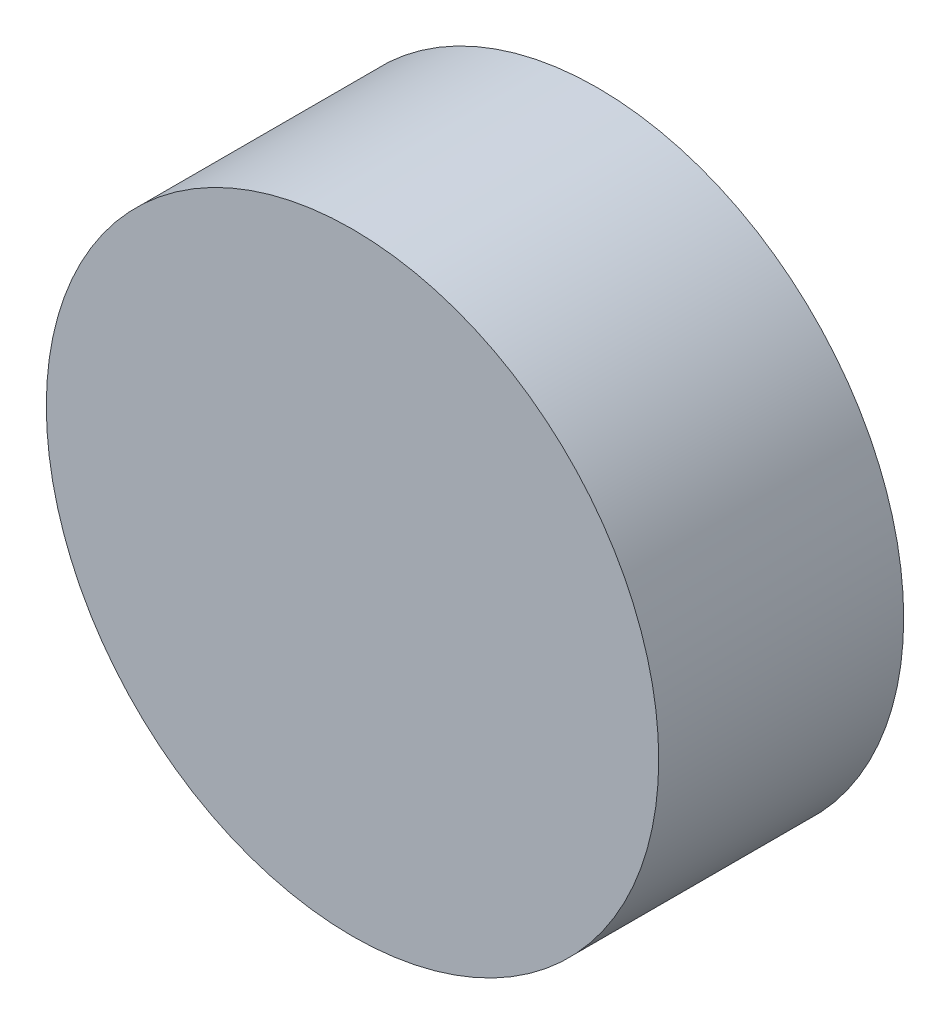
ISO-10303-21;
HEADER;
FILE_DESCRIPTION(('STEP AP214'),'2;1');
FILE_NAME('part.step','',(''),(''),'','','');
FILE_SCHEMA(('AUTOMOTIVE_DESIGN { 1 0 10303 214 1 1 1 1 }'));
ENDSEC;
DATA;
#1=APPLICATION_CONTEXT('core data for automotive mechanical design processes');
#2=APPLICATION_PROTOCOL_DEFINITION('international standard','automotive_design',2000,#1);
#3=PRODUCT_CONTEXT('',#1,'mechanical');
#4=PRODUCT('Part','Part','',(#3));
#5=PRODUCT_RELATED_PRODUCT_CATEGORY('part','',(#4));
#6=PRODUCT_DEFINITION_FORMATION('','',#4);
#7=PRODUCT_DEFINITION_CONTEXT('part definition',#1,'design');
#8=PRODUCT_DEFINITION('design','',#6,#7);
#9=PRODUCT_DEFINITION_SHAPE('','',#8);
#10=(LENGTH_UNIT() NAMED_UNIT(*) SI_UNIT(.MILLI.,.METRE.));
#11=(NAMED_UNIT(*) PLANE_ANGLE_UNIT() SI_UNIT($,.RADIAN.));
#12=(NAMED_UNIT(*) SI_UNIT($,.STERADIAN.) SOLID_ANGLE_UNIT());
#13=UNCERTAINTY_MEASURE_WITH_UNIT(LENGTH_MEASURE(1.E-05),#10,'distance_accuracy_value','');
#14=(GEOMETRIC_REPRESENTATION_CONTEXT(3) GLOBAL_UNCERTAINTY_ASSIGNED_CONTEXT((#13)) GLOBAL_UNIT_ASSIGNED_CONTEXT((#10,
#11,#12)) REPRESENTATION_CONTEXT('',''));
#15=CARTESIAN_POINT('',(0.,0.,0.));
#16=DIRECTION('',(0.,0.,1.));
#17=DIRECTION('',(1.,0.,0.));
#18=AXIS2_PLACEMENT_3D('',#15,#16,#17);
#19=CARTESIAN_POINT('',(0.,0.,2.));
#20=DIRECTION('',(0.,0.,-1.));
#21=DIRECTION('',(-1.,0.,0.));
#22=AXIS2_PLACEMENT_3D('',#19,#20,#21);
#23=CYLINDRICAL_SURFACE('',#22,2.5);
#24=CARTESIAN_POINT('',(0.,0.,2.));
#25=DIRECTION('',(0.,0.,1.));
#26=DIRECTION('',(1.,0.,0.));
#27=AXIS2_PLACEMENT_3D('',#24,#25,#26);
#28=CIRCLE('',#27,2.5);
#29=CARTESIAN_POINT('',(2.5,0.,2.));
#30=VERTEX_POINT('',#29);
#31=EDGE_CURVE('E10',#30,#30,#28,.T.);
#32=ORIENTED_EDGE('',*,*,#31,.F.);
#33=EDGE_LOOP('',(#32));
#34=FACE_BOUND('',#33,.T.);
#35=CARTESIAN_POINT('',(0.,0.,0.));
#36=DIRECTION('',(0.,0.,1.));
#37=DIRECTION('',(1.,0.,0.));
#38=AXIS2_PLACEMENT_3D('',#35,#36,#37);
#39=CIRCLE('',#38,2.5);
#40=CARTESIAN_POINT('',(2.5,0.,0.));
#41=VERTEX_POINT('',#40);
#42=EDGE_CURVE('E36',#41,#41,#39,.T.);
#43=ORIENTED_EDGE('',*,*,#42,.T.);
#44=EDGE_LOOP('',(#43));
#45=FACE_BOUND('',#44,.T.);
#46=ADVANCED_FACE('F33',(#34,#45),#23,.T.);
#47=CARTESIAN_POINT('',(0.,0.,2.));
#48=DIRECTION('',(0.,0.,1.));
#49=DIRECTION('',(1.,0.,0.));
#50=AXIS2_PLACEMENT_3D('',#47,#48,#49);
#51=PLANE('',#50);
#52=ORIENTED_EDGE('',*,*,#31,.T.);
#53=EDGE_LOOP('',(#52));
#54=FACE_BOUND('',#53,.T.);
#55=ADVANCED_FACE('F48',(#54),#51,.T.);
#56=CARTESIAN_POINT('',(0.,0.,0.));
#57=DIRECTION('',(0.,0.,1.));
#58=DIRECTION('',(1.,0.,0.));
#59=AXIS2_PLACEMENT_3D('',#56,#57,#58);
#60=PLANE('',#59);
#61=ORIENTED_EDGE('',*,*,#42,.F.);
#62=EDGE_LOOP('',(#61));
#63=FACE_BOUND('',#62,.T.);
#64=ADVANCED_FACE('F46',(#63),#60,.F.);
#65=CLOSED_SHELL('',(#46,#55,#64));
#66=MANIFOLD_SOLID_BREP('B2',#65);
#67=ADVANCED_BREP_SHAPE_REPRESENTATION('',(#18,#66),#14);
#68=SHAPE_DEFINITION_REPRESENTATION(#9,#67);
ENDSEC;
END-ISO-10303-21;
